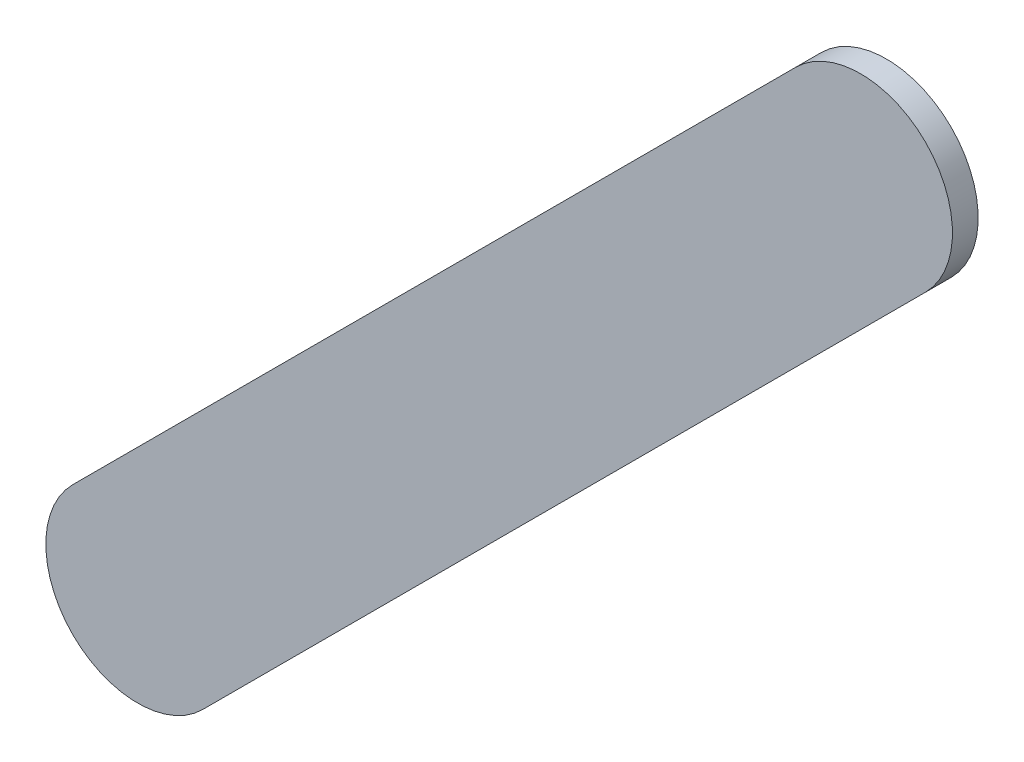
ISO-10303-21;
HEADER;
FILE_DESCRIPTION(('STEP AP214'),'2;1');
FILE_NAME('part.step','',(''),(''),'','','');
FILE_SCHEMA(('AUTOMOTIVE_DESIGN { 1 0 10303 214 1 1 1 1 }'));
ENDSEC;
DATA;
#1=APPLICATION_CONTEXT('core data for automotive mechanical design processes');
#2=APPLICATION_PROTOCOL_DEFINITION('international standard','automotive_design',2000,#1);
#3=PRODUCT_CONTEXT('',#1,'mechanical');
#4=PRODUCT('Part','Part','',(#3));
#5=PRODUCT_RELATED_PRODUCT_CATEGORY('part','',(#4));
#6=PRODUCT_DEFINITION_FORMATION('','',#4);
#7=PRODUCT_DEFINITION_CONTEXT('part definition',#1,'design');
#8=PRODUCT_DEFINITION('design','',#6,#7);
#9=PRODUCT_DEFINITION_SHAPE('','',#8);
#10=(LENGTH_UNIT() NAMED_UNIT(*) SI_UNIT(.MILLI.,.METRE.));
#11=(NAMED_UNIT(*) PLANE_ANGLE_UNIT() SI_UNIT($,.RADIAN.));
#12=(NAMED_UNIT(*) SI_UNIT($,.STERADIAN.) SOLID_ANGLE_UNIT());
#13=UNCERTAINTY_MEASURE_WITH_UNIT(LENGTH_MEASURE(1.E-05),#10,'distance_accuracy_value','');
#14=(GEOMETRIC_REPRESENTATION_CONTEXT(3) GLOBAL_UNCERTAINTY_ASSIGNED_CONTEXT((#13)) GLOBAL_UNIT_ASSIGNED_CONTEXT((#10,
#11,#12)) REPRESENTATION_CONTEXT('',''));
#15=CARTESIAN_POINT('',(0.,0.,0.));
#16=DIRECTION('',(0.,0.,1.));
#17=DIRECTION('',(1.,0.,0.));
#18=AXIS2_PLACEMENT_3D('',#15,#16,#17);
#19=CARTESIAN_POINT('',(93.50677514,91.69716992,0.));
#20=DIRECTION('',(-0.707106781186553,0.707106781186542,0.));
#21=DIRECTION('',(0.707106781186542,0.707106781186553,0.));
#22=AXIS2_PLACEMENT_3D('',#19,#20,#21);
#23=PLANE('',#22);
#24=DIRECTION('',(0.707106781186542,0.707106781186553,0.));
#25=VECTOR('',#24,1.);
#26=CARTESIAN_POINT('',(93.50677514,91.69716992,0.03556));
#27=LINE('',#26,#25);
#28=CARTESIAN_POINT('',(93.50677514,91.69716992,0.03556));
#29=VERTEX_POINT('',#28);
#30=CARTESIAN_POINT('',(94.50670202,92.6970968,0.03556));
#31=VERTEX_POINT('',#30);
#32=EDGE_CURVE('E11',#29,#31,#27,.T.);
#33=ORIENTED_EDGE('',*,*,#32,.F.);
#34=DIRECTION('',(0.,0.,1.));
#35=VECTOR('',#34,1.);
#36=CARTESIAN_POINT('',(93.50677514,91.69716992,0.));
#37=LINE('',#36,#35);
#38=CARTESIAN_POINT('',(93.50677514,91.69716992,0.));
#39=VERTEX_POINT('',#38);
#40=EDGE_CURVE('E24',#39,#29,#37,.T.);
#41=ORIENTED_EDGE('',*,*,#40,.F.);
#42=DIRECTION('',(0.707106781186542,0.707106781186553,0.));
#43=VECTOR('',#42,1.);
#44=CARTESIAN_POINT('',(93.50677514,91.69716992,0.));
#45=LINE('',#44,#43);
#46=CARTESIAN_POINT('',(94.50670202,92.6970968,0.));
#47=VERTEX_POINT('',#46);
#48=EDGE_CURVE('E75',#39,#47,#45,.T.);
#49=ORIENTED_EDGE('',*,*,#48,.T.);
#50=DIRECTION('',(0.,0.,1.));
#51=VECTOR('',#50,1.);
#52=CARTESIAN_POINT('',(94.50670202,92.6970968,0.));
#53=LINE('',#52,#51);
#54=EDGE_CURVE('E37',#47,#31,#53,.T.);
#55=ORIENTED_EDGE('',*,*,#54,.T.);
#56=EDGE_LOOP('',(#33,#41,#49,#55));
#57=FACE_BOUND('',#56,.T.);
#58=ADVANCED_FACE('F17',(#57),#23,.F.);
#59=CARTESIAN_POINT('',(94.41690032,92.7868985,0.));
#60=DIRECTION('',(0.,0.,-1.));
#61=DIRECTION('',(0.707106781186492,-0.707106781186604,0.));
#62=AXIS2_PLACEMENT_3D('',#59,#60,#61);
#63=CYLINDRICAL_SURFACE('',#62,0.12699878206416);
#64=CARTESIAN_POINT('',(94.41690032,92.7868985,0.03556));
#65=DIRECTION('',(0.,0.,1.));
#66=DIRECTION('',(0.707106781186492,-0.707106781186604,0.));
#67=AXIS2_PLACEMENT_3D('',#64,#65,#66);
#68=CIRCLE('',#67,0.12699878206416);
#69=CARTESIAN_POINT('',(94.32709862,92.8767002,0.03556));
#70=VERTEX_POINT('',#69);
#71=EDGE_CURVE('E83',#31,#70,#68,.T.);
#72=ORIENTED_EDGE('',*,*,#71,.F.);
#73=ORIENTED_EDGE('',*,*,#54,.F.);
#74=CARTESIAN_POINT('',(94.41690032,92.7868985,0.));
#75=DIRECTION('',(0.,0.,1.));
#76=DIRECTION('',(0.707106781186492,-0.707106781186604,0.));
#77=AXIS2_PLACEMENT_3D('',#74,#75,#76);
#78=CIRCLE('',#77,0.12699878206416);
#79=CARTESIAN_POINT('',(94.32709862,92.8767002,0.));
#80=VERTEX_POINT('',#79);
#81=EDGE_CURVE('E81',#47,#80,#78,.T.);
#82=ORIENTED_EDGE('',*,*,#81,.T.);
#83=DIRECTION('',(0.,0.,1.));
#84=VECTOR('',#83,1.);
#85=CARTESIAN_POINT('',(94.32709862,92.8767002,0.));
#86=LINE('',#85,#84);
#87=EDGE_CURVE('E67',#80,#70,#86,.T.);
#88=ORIENTED_EDGE('',*,*,#87,.T.);
#89=EDGE_LOOP('',(#72,#73,#82,#88));
#90=FACE_BOUND('',#89,.T.);
#91=ADVANCED_FACE('F89',(#90),#63,.T.);
#92=CARTESIAN_POINT('',(94.32709862,92.8767002,0.));
#93=DIRECTION('',(0.707106781186553,-0.707106781186542,0.));
#94=DIRECTION('',(-0.707106781186542,-0.707106781186553,0.));
#95=AXIS2_PLACEMENT_3D('',#92,#93,#94);
#96=PLANE('',#95);
#97=DIRECTION('',(-0.707106781186542,-0.707106781186553,0.));
#98=VECTOR('',#97,1.);
#99=CARTESIAN_POINT('',(94.32709862,92.8767002,0.03556));
#100=LINE('',#99,#98);
#101=CARTESIAN_POINT('',(93.32717174,91.87677332,0.03556));
#102=VERTEX_POINT('',#101);
#103=EDGE_CURVE('E71',#70,#102,#100,.T.);
#104=ORIENTED_EDGE('',*,*,#103,.F.);
#105=ORIENTED_EDGE('',*,*,#87,.F.);
#106=DIRECTION('',(-0.707106781186542,-0.707106781186553,0.));
#107=VECTOR('',#106,1.);
#108=CARTESIAN_POINT('',(94.32709862,92.8767002,0.));
#109=LINE('',#108,#107);
#110=CARTESIAN_POINT('',(93.32717174,91.87677332,0.));
#111=VERTEX_POINT('',#110);
#112=EDGE_CURVE('E63',#80,#111,#109,.T.);
#113=ORIENTED_EDGE('',*,*,#112,.T.);
#114=DIRECTION('',(0.,0.,1.));
#115=VECTOR('',#114,1.);
#116=CARTESIAN_POINT('',(93.32717174,91.87677332,0.));
#117=LINE('',#116,#115);
#118=EDGE_CURVE('E53',#111,#102,#117,.T.);
#119=ORIENTED_EDGE('',*,*,#118,.T.);
#120=EDGE_LOOP('',(#104,#105,#113,#119));
#121=FACE_BOUND('',#120,.T.);
#122=ADVANCED_FACE('F66',(#121),#96,.F.);
#123=CARTESIAN_POINT('',(93.41697344,91.78697162,0.));
#124=DIRECTION('',(0.,0.,-1.));
#125=DIRECTION('',(-0.707106781186548,0.707106781186548,0.));
#126=AXIS2_PLACEMENT_3D('',#123,#124,#125);
#127=CYLINDRICAL_SURFACE('',#126,0.126998782064163);
#128=CARTESIAN_POINT('',(93.41697344,91.78697162,0.03556));
#129=DIRECTION('',(0.,0.,1.));
#130=DIRECTION('',(-0.707106781186548,0.707106781186548,0.));
#131=AXIS2_PLACEMENT_3D('',#128,#129,#130);
#132=CIRCLE('',#131,0.126998782064163);
#133=EDGE_CURVE('E59',#102,#29,#132,.T.);
#134=ORIENTED_EDGE('',*,*,#133,.F.);
#135=ORIENTED_EDGE('',*,*,#118,.F.);
#136=CARTESIAN_POINT('',(93.41697344,91.78697162,0.));
#137=DIRECTION('',(0.,0.,1.));
#138=DIRECTION('',(-0.707106781186548,0.707106781186548,0.));
#139=AXIS2_PLACEMENT_3D('',#136,#137,#138);
#140=CIRCLE('',#139,0.126998782064163);
#141=EDGE_CURVE('E57',#111,#39,#140,.T.);
#142=ORIENTED_EDGE('',*,*,#141,.T.);
#143=ORIENTED_EDGE('',*,*,#40,.T.);
#144=EDGE_LOOP('',(#134,#135,#142,#143));
#145=FACE_BOUND('',#144,.T.);
#146=ADVANCED_FACE('F55',(#145),#127,.T.);
#147=CARTESIAN_POINT('',(93.50677514,91.69716992,0.));
#148=DIRECTION('',(0.,0.,-1.));
#149=DIRECTION('',(-1.,0.,0.));
#150=AXIS2_PLACEMENT_3D('',#147,#148,#149);
#151=PLANE('',#150);
#152=ORIENTED_EDGE('',*,*,#141,.F.);
#153=ORIENTED_EDGE('',*,*,#112,.F.);
#154=ORIENTED_EDGE('',*,*,#81,.F.);
#155=ORIENTED_EDGE('',*,*,#48,.F.);
#156=EDGE_LOOP('',(#152,#153,#154,#155));
#157=FACE_BOUND('',#156,.T.);
#158=ADVANCED_FACE('F74',(#157),#151,.T.);
#159=CARTESIAN_POINT('',(93.50677514,91.69716992,0.03556));
#160=DIRECTION('',(0.,0.,-1.));
#161=DIRECTION('',(-1.,0.,0.));
#162=AXIS2_PLACEMENT_3D('',#159,#160,#161);
#163=PLANE('',#162);
#164=ORIENTED_EDGE('',*,*,#32,.T.);
#165=ORIENTED_EDGE('',*,*,#71,.T.);
#166=ORIENTED_EDGE('',*,*,#103,.T.);
#167=ORIENTED_EDGE('',*,*,#133,.T.);
#168=EDGE_LOOP('',(#164,#165,#166,#167));
#169=FACE_BOUND('',#168,.T.);
#170=ADVANCED_FACE('F91',(#169),#163,.F.);
#171=CLOSED_SHELL('',(#58,#91,#122,#146,#158,#170));
#172=MANIFOLD_SOLID_BREP('B1',#171);
#173=ADVANCED_BREP_SHAPE_REPRESENTATION('',(#18,#172),#14);
#174=SHAPE_DEFINITION_REPRESENTATION(#9,#173);
ENDSEC;
END-ISO-10303-21;
